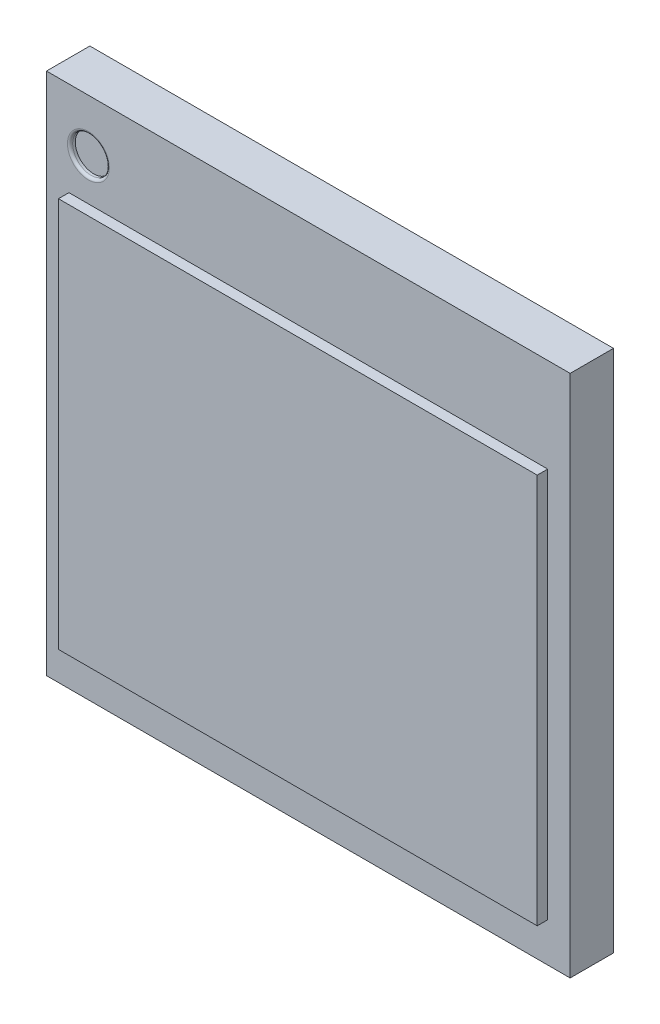
ISO-10303-21;
HEADER;
FILE_DESCRIPTION(('STEP AP214'),'2;1');
FILE_NAME('part.step','',(''),(''),'','','');
FILE_SCHEMA(('AUTOMOTIVE_DESIGN { 1 0 10303 214 1 1 1 1 }'));
ENDSEC;
DATA;
#1=APPLICATION_CONTEXT('core data for automotive mechanical design processes');
#2=APPLICATION_PROTOCOL_DEFINITION('international standard','automotive_design',2000,#1);
#3=PRODUCT_CONTEXT('',#1,'mechanical');
#4=PRODUCT('Part','Part','',(#3));
#5=PRODUCT_RELATED_PRODUCT_CATEGORY('part','',(#4));
#6=PRODUCT_DEFINITION_FORMATION('','',#4);
#7=PRODUCT_DEFINITION_CONTEXT('part definition',#1,'design');
#8=PRODUCT_DEFINITION('design','',#6,#7);
#9=PRODUCT_DEFINITION_SHAPE('','',#8);
#10=(LENGTH_UNIT() NAMED_UNIT(*) SI_UNIT(.MILLI.,.METRE.));
#11=(NAMED_UNIT(*) PLANE_ANGLE_UNIT() SI_UNIT($,.RADIAN.));
#12=(NAMED_UNIT(*) SI_UNIT($,.STERADIAN.) SOLID_ANGLE_UNIT());
#13=UNCERTAINTY_MEASURE_WITH_UNIT(LENGTH_MEASURE(1.E-05),#10,'distance_accuracy_value','');
#14=(GEOMETRIC_REPRESENTATION_CONTEXT(3) GLOBAL_UNCERTAINTY_ASSIGNED_CONTEXT((#13)) GLOBAL_UNIT_ASSIGNED_CONTEXT((#10,
#11,#12)) REPRESENTATION_CONTEXT('',''));
#15=CARTESIAN_POINT('',(0.,0.,0.));
#16=DIRECTION('',(0.,0.,1.));
#17=DIRECTION('',(1.,0.,0.));
#18=AXIS2_PLACEMENT_3D('',#15,#16,#17);
#19=CARTESIAN_POINT('',(0.,0.,0.624));
#20=DIRECTION('',(0.,0.,1.));
#21=DIRECTION('',(1.,0.,0.));
#22=AXIS2_PLACEMENT_3D('',#19,#20,#21);
#23=PLANE('',#22);
#24=CARTESIAN_POINT('',(-2.1,2.,0.624));
#25=DIRECTION('',(0.,0.,1.));
#26=DIRECTION('',(1.,0.,0.));
#27=AXIS2_PLACEMENT_3D('',#24,#25,#26);
#28=CIRCLE('',#27,0.2);
#29=CARTESIAN_POINT('',(-1.9,2.,0.624));
#30=VERTEX_POINT('',#29);
#31=EDGE_CURVE('E11',#30,#30,#28,.F.);
#32=ORIENTED_EDGE('',*,*,#31,.T.);
#33=EDGE_LOOP('',(#32));
#34=FACE_BOUND('',#33,.T.);
#35=DIRECTION('',(0.,-1.,0.));
#36=VECTOR('',#35,1.);
#37=CARTESIAN_POINT('',(-2.5,2.5,0.624));
#38=LINE('',#37,#36);
#39=CARTESIAN_POINT('',(-2.5,2.5,0.624));
#40=VERTEX_POINT('',#39);
#41=CARTESIAN_POINT('',(-2.5,-2.5,0.624));
#42=VERTEX_POINT('',#41);
#43=EDGE_CURVE('E144',#40,#42,#38,.T.);
#44=ORIENTED_EDGE('',*,*,#43,.T.);
#45=DIRECTION('',(1.,0.,0.));
#46=VECTOR('',#45,1.);
#47=CARTESIAN_POINT('',(-2.5,-2.5,0.624));
#48=LINE('',#47,#46);
#49=CARTESIAN_POINT('',(2.5,-2.5,0.624));
#50=VERTEX_POINT('',#49);
#51=EDGE_CURVE('E89',#42,#50,#48,.T.);
#52=ORIENTED_EDGE('',*,*,#51,.T.);
#53=DIRECTION('',(0.,1.,0.));
#54=VECTOR('',#53,1.);
#55=CARTESIAN_POINT('',(2.5,2.5,0.624));
#56=LINE('',#55,#54);
#57=CARTESIAN_POINT('',(2.5,2.5,0.624));
#58=VERTEX_POINT('',#57);
#59=EDGE_CURVE('E147',#50,#58,#56,.T.);
#60=ORIENTED_EDGE('',*,*,#59,.T.);
#61=DIRECTION('',(-1.,0.,0.));
#62=VECTOR('',#61,1.);
#63=CARTESIAN_POINT('',(-2.5,2.5,0.624));
#64=LINE('',#63,#62);
#65=EDGE_CURVE('E60',#58,#40,#64,.T.);
#66=ORIENTED_EDGE('',*,*,#65,.T.);
#67=EDGE_LOOP('',(#44,#52,#60,#66));
#68=FACE_BOUND('',#67,.T.);
#69=DIRECTION('',(-1.,0.,0.));
#70=VECTOR('',#69,1.);
#71=CARTESIAN_POINT('',(-2.28579882244162,1.60135243721626,0.624));
#72=LINE('',#71,#70);
#73=CARTESIAN_POINT('',(2.28579882244162,1.60135243721626,0.624));
#74=VERTEX_POINT('',#73);
#75=CARTESIAN_POINT('',(-2.28579882244162,1.60135243721626,0.624));
#76=VERTEX_POINT('',#75);
#77=EDGE_CURVE('E302',#74,#76,#72,.T.);
#78=ORIENTED_EDGE('',*,*,#77,.F.);
#79=DIRECTION('',(0.,1.,0.));
#80=VECTOR('',#79,1.);
#81=CARTESIAN_POINT('',(2.28579882244162,1.60135243721626,0.624));
#82=LINE('',#81,#80);
#83=CARTESIAN_POINT('',(2.28579882244162,-2.125692027521,0.624));
#84=VERTEX_POINT('',#83);
#85=EDGE_CURVE('E134',#84,#74,#82,.T.);
#86=ORIENTED_EDGE('',*,*,#85,.F.);
#87=DIRECTION('',(1.,0.,0.));
#88=VECTOR('',#87,1.);
#89=CARTESIAN_POINT('',(-2.28579882244162,-2.125692027521,0.624));
#90=LINE('',#89,#88);
#91=CARTESIAN_POINT('',(-2.28579882244162,-2.125692027521,0.624));
#92=VERTEX_POINT('',#91);
#93=EDGE_CURVE('E130',#92,#84,#90,.T.);
#94=ORIENTED_EDGE('',*,*,#93,.F.);
#95=DIRECTION('',(0.,-1.,0.));
#96=VECTOR('',#95,1.);
#97=CARTESIAN_POINT('',(-2.28579882244162,1.60135243721626,0.624));
#98=LINE('',#97,#96);
#99=EDGE_CURVE('E304',#76,#92,#98,.T.);
#100=ORIENTED_EDGE('',*,*,#99,.F.);
#101=EDGE_LOOP('',(#78,#86,#94,#100));
#102=FACE_BOUND('',#101,.T.);
#103=ADVANCED_FACE('F36',(#34,#68,#102),#23,.T.);
#104=CARTESIAN_POINT('',(0.,0.,0.21));
#105=DIRECTION('',(0.,0.,1.));
#106=DIRECTION('',(1.,0.,0.));
#107=AXIS2_PLACEMENT_3D('',#104,#105,#106);
#108=PLANE('',#107);
#109=DIRECTION('',(0.,-1.,0.));
#110=VECTOR('',#109,1.);
#111=CARTESIAN_POINT('',(-2.5,2.5,0.21));
#112=LINE('',#111,#110);
#113=CARTESIAN_POINT('',(-2.5,2.5,0.21));
#114=VERTEX_POINT('',#113);
#115=CARTESIAN_POINT('',(-2.5,-2.5,0.21));
#116=VERTEX_POINT('',#115);
#117=EDGE_CURVE('E139',#114,#116,#112,.T.);
#118=ORIENTED_EDGE('',*,*,#117,.F.);
#119=DIRECTION('',(-1.,0.,0.));
#120=VECTOR('',#119,1.);
#121=CARTESIAN_POINT('',(-2.5,2.5,0.21));
#122=LINE('',#121,#120);
#123=CARTESIAN_POINT('',(2.5,2.5,0.21));
#124=VERTEX_POINT('',#123);
#125=EDGE_CURVE('E81',#124,#114,#122,.T.);
#126=ORIENTED_EDGE('',*,*,#125,.F.);
#127=DIRECTION('',(0.,1.,0.));
#128=VECTOR('',#127,1.);
#129=CARTESIAN_POINT('',(2.5,2.5,0.21));
#130=LINE('',#129,#128);
#131=CARTESIAN_POINT('',(2.5,-2.5,0.21));
#132=VERTEX_POINT('',#131);
#133=EDGE_CURVE('E155',#132,#124,#130,.T.);
#134=ORIENTED_EDGE('',*,*,#133,.F.);
#135=DIRECTION('',(1.,0.,0.));
#136=VECTOR('',#135,1.);
#137=CARTESIAN_POINT('',(-2.5,-2.5,0.21));
#138=LINE('',#137,#136);
#139=EDGE_CURVE('E153',#116,#132,#138,.T.);
#140=ORIENTED_EDGE('',*,*,#139,.F.);
#141=EDGE_LOOP('',(#118,#126,#134,#140));
#142=FACE_BOUND('',#141,.T.);
#143=CARTESIAN_POINT('',(-1.96,1.9,0.21));
#144=DIRECTION('',(0.,0.,1.));
#145=DIRECTION('',(1.,0.,0.));
#146=AXIS2_PLACEMENT_3D('',#143,#144,#145);
#147=CIRCLE('',#146,0.148492424049175);
#148=CARTESIAN_POINT('',(-1.81150757595082,1.9,0.21));
#149=VERTEX_POINT('',#148);
#150=EDGE_CURVE('E166',#149,#149,#147,.F.);
#151=ORIENTED_EDGE('',*,*,#150,.F.);
#152=EDGE_LOOP('',(#151));
#153=FACE_BOUND('',#152,.T.);
#154=CARTESIAN_POINT('',(-1.16,1.9,0.21));
#155=DIRECTION('',(0.,0.,1.));
#156=DIRECTION('',(1.,0.,0.));
#157=AXIS2_PLACEMENT_3D('',#154,#155,#156);
#158=CIRCLE('',#157,0.148492424049175);
#159=CARTESIAN_POINT('',(-1.01150757595082,1.9,0.21));
#160=VERTEX_POINT('',#159);
#161=EDGE_CURVE('E169',#160,#160,#158,.F.);
#162=ORIENTED_EDGE('',*,*,#161,.F.);
#163=EDGE_LOOP('',(#162));
#164=FACE_BOUND('',#163,.T.);
#165=CARTESIAN_POINT('',(-0.36,1.9,0.21));
#166=DIRECTION('',(0.,0.,1.));
#167=DIRECTION('',(1.,0.,0.));
#168=AXIS2_PLACEMENT_3D('',#165,#166,#167);
#169=CIRCLE('',#168,0.148492424049175);
#170=CARTESIAN_POINT('',(-0.211507575950825,1.9,0.21));
#171=VERTEX_POINT('',#170);
#172=EDGE_CURVE('E172',#171,#171,#169,.F.);
#173=ORIENTED_EDGE('',*,*,#172,.F.);
#174=EDGE_LOOP('',(#173));
#175=FACE_BOUND('',#174,.T.);
#176=CARTESIAN_POINT('',(0.44,1.9,0.21));
#177=DIRECTION('',(0.,0.,1.));
#178=DIRECTION('',(1.,0.,0.));
#179=AXIS2_PLACEMENT_3D('',#176,#177,#178);
#180=CIRCLE('',#179,0.148492424049175);
#181=CARTESIAN_POINT('',(0.588492424049175,1.9,0.21));
#182=VERTEX_POINT('',#181);
#183=EDGE_CURVE('E175',#182,#182,#180,.F.);
#184=ORIENTED_EDGE('',*,*,#183,.F.);
#185=EDGE_LOOP('',(#184));
#186=FACE_BOUND('',#185,.T.);
#187=CARTESIAN_POINT('',(1.24,1.9,0.21));
#188=DIRECTION('',(0.,0.,1.));
#189=DIRECTION('',(1.,0.,0.));
#190=AXIS2_PLACEMENT_3D('',#187,#188,#189);
#191=CIRCLE('',#190,0.148492424049175);
#192=CARTESIAN_POINT('',(1.38849242404918,1.9,0.21));
#193=VERTEX_POINT('',#192);
#194=EDGE_CURVE('E178',#193,#193,#191,.F.);
#195=ORIENTED_EDGE('',*,*,#194,.F.);
#196=EDGE_LOOP('',(#195));
#197=FACE_BOUND('',#196,.T.);
#198=CARTESIAN_POINT('',(2.04,1.9,0.21));
#199=DIRECTION('',(0.,0.,1.));
#200=DIRECTION('',(1.,0.,0.));
#201=AXIS2_PLACEMENT_3D('',#198,#199,#200);
#202=CIRCLE('',#201,0.148492424049175);
#203=CARTESIAN_POINT('',(2.18849242404918,1.9,0.21));
#204=VERTEX_POINT('',#203);
#205=EDGE_CURVE('E181',#204,#204,#202,.F.);
#206=ORIENTED_EDGE('',*,*,#205,.F.);
#207=EDGE_LOOP('',(#206));
#208=FACE_BOUND('',#207,.T.);
#209=CARTESIAN_POINT('',(-1.96,1.15,0.21));
#210=DIRECTION('',(0.,0.,1.));
#211=DIRECTION('',(1.,0.,0.));
#212=AXIS2_PLACEMENT_3D('',#209,#210,#211);
#213=CIRCLE('',#212,0.148492424049175);
#214=CARTESIAN_POINT('',(-1.81150757595082,1.15,0.21));
#215=VERTEX_POINT('',#214);
#216=EDGE_CURVE('E184',#215,#215,#213,.F.);
#217=ORIENTED_EDGE('',*,*,#216,.F.);
#218=EDGE_LOOP('',(#217));
#219=FACE_BOUND('',#218,.T.);
#220=CARTESIAN_POINT('',(-1.16,1.15,0.21));
#221=DIRECTION('',(0.,0.,1.));
#222=DIRECTION('',(1.,0.,0.));
#223=AXIS2_PLACEMENT_3D('',#220,#221,#222);
#224=CIRCLE('',#223,0.148492424049175);
#225=CARTESIAN_POINT('',(-1.01150757595082,1.15,0.21));
#226=VERTEX_POINT('',#225);
#227=EDGE_CURVE('E187',#226,#226,#224,.F.);
#228=ORIENTED_EDGE('',*,*,#227,.F.);
#229=EDGE_LOOP('',(#228));
#230=FACE_BOUND('',#229,.T.);
#231=CARTESIAN_POINT('',(-0.36,1.15,0.21));
#232=DIRECTION('',(0.,0.,1.));
#233=DIRECTION('',(1.,0.,0.));
#234=AXIS2_PLACEMENT_3D('',#231,#232,#233);
#235=CIRCLE('',#234,0.148492424049175);
#236=CARTESIAN_POINT('',(-0.211507575950825,1.15,0.21));
#237=VERTEX_POINT('',#236);
#238=EDGE_CURVE('E190',#237,#237,#235,.F.);
#239=ORIENTED_EDGE('',*,*,#238,.F.);
#240=EDGE_LOOP('',(#239));
#241=FACE_BOUND('',#240,.T.);
#242=CARTESIAN_POINT('',(0.44,1.15,0.21));
#243=DIRECTION('',(0.,0.,1.));
#244=DIRECTION('',(1.,0.,0.));
#245=AXIS2_PLACEMENT_3D('',#242,#243,#244);
#246=CIRCLE('',#245,0.148492424049175);
#247=CARTESIAN_POINT('',(0.588492424049175,1.15,0.21));
#248=VERTEX_POINT('',#247);
#249=EDGE_CURVE('E193',#248,#248,#246,.F.);
#250=ORIENTED_EDGE('',*,*,#249,.F.);
#251=EDGE_LOOP('',(#250));
#252=FACE_BOUND('',#251,.T.);
#253=CARTESIAN_POINT('',(1.24,1.15,0.21));
#254=DIRECTION('',(0.,0.,1.));
#255=DIRECTION('',(1.,0.,0.));
#256=AXIS2_PLACEMENT_3D('',#253,#254,#255);
#257=CIRCLE('',#256,0.148492424049175);
#258=CARTESIAN_POINT('',(1.38849242404918,1.15,0.21));
#259=VERTEX_POINT('',#258);
#260=EDGE_CURVE('E196',#259,#259,#257,.F.);
#261=ORIENTED_EDGE('',*,*,#260,.F.);
#262=EDGE_LOOP('',(#261));
#263=FACE_BOUND('',#262,.T.);
#264=CARTESIAN_POINT('',(2.04,1.15,0.21));
#265=DIRECTION('',(0.,0.,1.));
#266=DIRECTION('',(1.,0.,0.));
#267=AXIS2_PLACEMENT_3D('',#264,#265,#266);
#268=CIRCLE('',#267,0.148492424049175);
#269=CARTESIAN_POINT('',(2.18849242404918,1.15,0.21));
#270=VERTEX_POINT('',#269);
#271=EDGE_CURVE('E199',#270,#270,#268,.F.);
#272=ORIENTED_EDGE('',*,*,#271,.F.);
#273=EDGE_LOOP('',(#272));
#274=FACE_BOUND('',#273,.T.);
#275=CARTESIAN_POINT('',(-1.96,0.4,0.21));
#276=DIRECTION('',(0.,0.,1.));
#277=DIRECTION('',(1.,0.,0.));
#278=AXIS2_PLACEMENT_3D('',#275,#276,#277);
#279=CIRCLE('',#278,0.148492424049175);
#280=CARTESIAN_POINT('',(-1.81150757595082,0.4,0.21));
#281=VERTEX_POINT('',#280);
#282=EDGE_CURVE('E202',#281,#281,#279,.F.);
#283=ORIENTED_EDGE('',*,*,#282,.F.);
#284=EDGE_LOOP('',(#283));
#285=FACE_BOUND('',#284,.T.);
#286=CARTESIAN_POINT('',(2.04,0.399999999999999,0.21));
#287=DIRECTION('',(0.,0.,1.));
#288=DIRECTION('',(1.,0.,0.));
#289=AXIS2_PLACEMENT_3D('',#286,#287,#288);
#290=CIRCLE('',#289,0.148492424049175);
#291=CARTESIAN_POINT('',(2.18849242404918,0.399999999999999,0.21));
#292=VERTEX_POINT('',#291);
#293=EDGE_CURVE('E205',#292,#292,#290,.F.);
#294=ORIENTED_EDGE('',*,*,#293,.F.);
#295=EDGE_LOOP('',(#294));
#296=FACE_BOUND('',#295,.T.);
#297=CARTESIAN_POINT('',(-1.96,-0.35,0.21));
#298=DIRECTION('',(0.,0.,1.));
#299=DIRECTION('',(1.,0.,0.));
#300=AXIS2_PLACEMENT_3D('',#297,#298,#299);
#301=CIRCLE('',#300,0.148492424049175);
#302=CARTESIAN_POINT('',(-1.81150757595082,-0.35,0.21));
#303=VERTEX_POINT('',#302);
#304=EDGE_CURVE('E208',#303,#303,#301,.F.);
#305=ORIENTED_EDGE('',*,*,#304,.F.);
#306=EDGE_LOOP('',(#305));
#307=FACE_BOUND('',#306,.T.);
#308=CARTESIAN_POINT('',(2.04,-0.350000000000001,0.21));
#309=DIRECTION('',(0.,0.,1.));
#310=DIRECTION('',(1.,0.,0.));
#311=AXIS2_PLACEMENT_3D('',#308,#309,#310);
#312=CIRCLE('',#311,0.148492424049175);
#313=CARTESIAN_POINT('',(2.18849242404918,-0.350000000000001,0.21));
#314=VERTEX_POINT('',#313);
#315=EDGE_CURVE('E211',#314,#314,#312,.F.);
#316=ORIENTED_EDGE('',*,*,#315,.F.);
#317=EDGE_LOOP('',(#316));
#318=FACE_BOUND('',#317,.T.);
#319=CARTESIAN_POINT('',(-1.96,-1.1,0.21));
#320=DIRECTION('',(0.,0.,1.));
#321=DIRECTION('',(1.,0.,0.));
#322=AXIS2_PLACEMENT_3D('',#319,#320,#321);
#323=CIRCLE('',#322,0.148492424049175);
#324=CARTESIAN_POINT('',(-1.81150757595082,-1.1,0.21));
#325=VERTEX_POINT('',#324);
#326=EDGE_CURVE('E214',#325,#325,#323,.F.);
#327=ORIENTED_EDGE('',*,*,#326,.F.);
#328=EDGE_LOOP('',(#327));
#329=FACE_BOUND('',#328,.T.);
#330=CARTESIAN_POINT('',(-1.16,-1.1,0.21));
#331=DIRECTION('',(0.,0.,1.));
#332=DIRECTION('',(1.,0.,0.));
#333=AXIS2_PLACEMENT_3D('',#330,#331,#332);
#334=CIRCLE('',#333,0.148492424049175);
#335=CARTESIAN_POINT('',(-1.01150757595082,-1.1,0.21));
#336=VERTEX_POINT('',#335);
#337=EDGE_CURVE('E217',#336,#336,#334,.F.);
#338=ORIENTED_EDGE('',*,*,#337,.F.);
#339=EDGE_LOOP('',(#338));
#340=FACE_BOUND('',#339,.T.);
#341=CARTESIAN_POINT('',(-0.359999999999999,-1.1,0.21));
#342=DIRECTION('',(0.,0.,1.));
#343=DIRECTION('',(1.,0.,0.));
#344=AXIS2_PLACEMENT_3D('',#341,#342,#343);
#345=CIRCLE('',#344,0.148492424049175);
#346=CARTESIAN_POINT('',(-0.211507575950824,-1.1,0.21));
#347=VERTEX_POINT('',#346);
#348=EDGE_CURVE('E220',#347,#347,#345,.F.);
#349=ORIENTED_EDGE('',*,*,#348,.F.);
#350=EDGE_LOOP('',(#349));
#351=FACE_BOUND('',#350,.T.);
#352=CARTESIAN_POINT('',(0.440000000000001,-1.1,0.21));
#353=DIRECTION('',(0.,0.,1.));
#354=DIRECTION('',(1.,0.,0.));
#355=AXIS2_PLACEMENT_3D('',#352,#353,#354);
#356=CIRCLE('',#355,0.148492424049175);
#357=CARTESIAN_POINT('',(0.588492424049176,-1.1,0.21));
#358=VERTEX_POINT('',#357);
#359=EDGE_CURVE('E223',#358,#358,#356,.F.);
#360=ORIENTED_EDGE('',*,*,#359,.F.);
#361=EDGE_LOOP('',(#360));
#362=FACE_BOUND('',#361,.T.);
#363=CARTESIAN_POINT('',(1.24,-1.1,0.21));
#364=DIRECTION('',(0.,0.,1.));
#365=DIRECTION('',(1.,0.,0.));
#366=AXIS2_PLACEMENT_3D('',#363,#364,#365);
#367=CIRCLE('',#366,0.148492424049175);
#368=CARTESIAN_POINT('',(1.38849242404918,-1.1,0.21));
#369=VERTEX_POINT('',#368);
#370=EDGE_CURVE('E226',#369,#369,#367,.F.);
#371=ORIENTED_EDGE('',*,*,#370,.F.);
#372=EDGE_LOOP('',(#371));
#373=FACE_BOUND('',#372,.T.);
#374=CARTESIAN_POINT('',(2.04,-1.1,0.21));
#375=DIRECTION('',(0.,0.,1.));
#376=DIRECTION('',(1.,0.,0.));
#377=AXIS2_PLACEMENT_3D('',#374,#375,#376);
#378=CIRCLE('',#377,0.148492424049175);
#379=CARTESIAN_POINT('',(2.18849242404918,-1.1,0.21));
#380=VERTEX_POINT('',#379);
#381=EDGE_CURVE('E229',#380,#380,#378,.F.);
#382=ORIENTED_EDGE('',*,*,#381,.F.);
#383=EDGE_LOOP('',(#382));
#384=FACE_BOUND('',#383,.T.);
#385=CARTESIAN_POINT('',(-1.96,-1.85,0.21));
#386=DIRECTION('',(0.,0.,1.));
#387=DIRECTION('',(1.,0.,0.));
#388=AXIS2_PLACEMENT_3D('',#385,#386,#387);
#389=CIRCLE('',#388,0.148492424049175);
#390=CARTESIAN_POINT('',(-1.81150757595082,-1.85,0.21));
#391=VERTEX_POINT('',#390);
#392=EDGE_CURVE('E232',#391,#391,#389,.F.);
#393=ORIENTED_EDGE('',*,*,#392,.F.);
#394=EDGE_LOOP('',(#393));
#395=FACE_BOUND('',#394,.T.);
#396=CARTESIAN_POINT('',(-1.16,-1.85,0.21));
#397=DIRECTION('',(0.,0.,1.));
#398=DIRECTION('',(1.,0.,0.));
#399=AXIS2_PLACEMENT_3D('',#396,#397,#398);
#400=CIRCLE('',#399,0.148492424049175);
#401=CARTESIAN_POINT('',(-1.01150757595082,-1.85,0.21));
#402=VERTEX_POINT('',#401);
#403=EDGE_CURVE('E235',#402,#402,#400,.F.);
#404=ORIENTED_EDGE('',*,*,#403,.F.);
#405=EDGE_LOOP('',(#404));
#406=FACE_BOUND('',#405,.T.);
#407=CARTESIAN_POINT('',(-0.359999999999999,-1.85,0.21));
#408=DIRECTION('',(0.,0.,1.));
#409=DIRECTION('',(1.,0.,0.));
#410=AXIS2_PLACEMENT_3D('',#407,#408,#409);
#411=CIRCLE('',#410,0.148492424049175);
#412=CARTESIAN_POINT('',(-0.211507575950824,-1.85,0.21));
#413=VERTEX_POINT('',#412);
#414=EDGE_CURVE('E238',#413,#413,#411,.F.);
#415=ORIENTED_EDGE('',*,*,#414,.F.);
#416=EDGE_LOOP('',(#415));
#417=FACE_BOUND('',#416,.T.);
#418=CARTESIAN_POINT('',(0.440000000000001,-1.85,0.21));
#419=DIRECTION('',(0.,0.,1.));
#420=DIRECTION('',(1.,0.,0.));
#421=AXIS2_PLACEMENT_3D('',#418,#419,#420);
#422=CIRCLE('',#421,0.148492424049175);
#423=CARTESIAN_POINT('',(0.588492424049176,-1.85,0.21));
#424=VERTEX_POINT('',#423);
#425=EDGE_CURVE('E241',#424,#424,#422,.F.);
#426=ORIENTED_EDGE('',*,*,#425,.F.);
#427=EDGE_LOOP('',(#426));
#428=FACE_BOUND('',#427,.T.);
#429=CARTESIAN_POINT('',(1.24,-1.85,0.21));
#430=DIRECTION('',(0.,0.,1.));
#431=DIRECTION('',(1.,0.,0.));
#432=AXIS2_PLACEMENT_3D('',#429,#430,#431);
#433=CIRCLE('',#432,0.148492424049175);
#434=CARTESIAN_POINT('',(1.38849242404918,-1.85,0.21));
#435=VERTEX_POINT('',#434);
#436=EDGE_CURVE('E244',#435,#435,#433,.F.);
#437=ORIENTED_EDGE('',*,*,#436,.F.);
#438=EDGE_LOOP('',(#437));
#439=FACE_BOUND('',#438,.T.);
#440=CARTESIAN_POINT('',(2.04,-1.85,0.21));
#441=DIRECTION('',(0.,0.,1.));
#442=DIRECTION('',(1.,0.,0.));
#443=AXIS2_PLACEMENT_3D('',#440,#441,#442);
#444=CIRCLE('',#443,0.148492424049175);
#445=CARTESIAN_POINT('',(2.18849242404918,-1.85,0.21));
#446=VERTEX_POINT('',#445);
#447=EDGE_CURVE('E247',#446,#446,#444,.F.);
#448=ORIENTED_EDGE('',*,*,#447,.F.);
#449=EDGE_LOOP('',(#448));
#450=FACE_BOUND('',#449,.T.);
#451=ADVANCED_FACE('F267',(#142,#153,#164,#175,#186,#197,#208,#219,#230,#241,#252,#263,#274,
#285,#296,#307,#318,#329,#340,#351,#362,#373,#384,#395,#406,#417,#428,#439,#450),#108,.F.);
#452=CARTESIAN_POINT('',(-2.5,2.5,0.624));
#453=DIRECTION('',(1.,0.,0.));
#454=DIRECTION('',(0.,1.,0.));
#455=AXIS2_PLACEMENT_3D('',#452,#453,#454);
#456=PLANE('',#455);
#457=ORIENTED_EDGE('',*,*,#117,.T.);
#458=DIRECTION('',(0.,0.,-1.));
#459=VECTOR('',#458,1.);
#460=CARTESIAN_POINT('',(-2.5,-2.5,0.624));
#461=LINE('',#460,#459);
#462=EDGE_CURVE('E164',#42,#116,#461,.T.);
#463=ORIENTED_EDGE('',*,*,#462,.F.);
#464=ORIENTED_EDGE('',*,*,#43,.F.);
#465=DIRECTION('',(0.,0.,-1.));
#466=VECTOR('',#465,1.);
#467=CARTESIAN_POINT('',(-2.5,2.5,0.624));
#468=LINE('',#467,#466);
#469=EDGE_CURVE('E150',#40,#114,#468,.T.);
#470=ORIENTED_EDGE('',*,*,#469,.T.);
#471=EDGE_LOOP('',(#457,#463,#464,#470));
#472=FACE_BOUND('',#471,.T.);
#473=ADVANCED_FACE('F273',(#472),#456,.F.);
#474=CARTESIAN_POINT('',(-2.5,-2.5,0.624));
#475=DIRECTION('',(0.,1.,0.));
#476=DIRECTION('',(0.,0.,1.));
#477=AXIS2_PLACEMENT_3D('',#474,#475,#476);
#478=PLANE('',#477);
#479=ORIENTED_EDGE('',*,*,#139,.T.);
#480=DIRECTION('',(0.,0.,-1.));
#481=VECTOR('',#480,1.);
#482=CARTESIAN_POINT('',(2.5,-2.5,0.624));
#483=LINE('',#482,#481);
#484=EDGE_CURVE('E161',#50,#132,#483,.T.);
#485=ORIENTED_EDGE('',*,*,#484,.F.);
#486=ORIENTED_EDGE('',*,*,#51,.F.);
#487=ORIENTED_EDGE('',*,*,#462,.T.);
#488=EDGE_LOOP('',(#479,#485,#486,#487));
#489=FACE_BOUND('',#488,.T.);
#490=ADVANCED_FACE('F286',(#489),#478,.F.);
#491=CARTESIAN_POINT('',(2.5,2.5,0.624));
#492=DIRECTION('',(-1.,0.,0.));
#493=DIRECTION('',(0.,0.,1.));
#494=AXIS2_PLACEMENT_3D('',#491,#492,#493);
#495=PLANE('',#494);
#496=ORIENTED_EDGE('',*,*,#133,.T.);
#497=DIRECTION('',(0.,0.,-1.));
#498=VECTOR('',#497,1.);
#499=CARTESIAN_POINT('',(2.5,2.5,0.624));
#500=LINE('',#499,#498);
#501=EDGE_CURVE('E159',#58,#124,#500,.T.);
#502=ORIENTED_EDGE('',*,*,#501,.F.);
#503=ORIENTED_EDGE('',*,*,#59,.F.);
#504=ORIENTED_EDGE('',*,*,#484,.T.);
#505=EDGE_LOOP('',(#496,#502,#503,#504));
#506=FACE_BOUND('',#505,.T.);
#507=ADVANCED_FACE('F283',(#506),#495,.F.);
#508=CARTESIAN_POINT('',(-2.5,2.5,0.624));
#509=DIRECTION('',(0.,-1.,0.));
#510=DIRECTION('',(1.,0.,0.));
#511=AXIS2_PLACEMENT_3D('',#508,#509,#510);
#512=PLANE('',#511);
#513=ORIENTED_EDGE('',*,*,#125,.T.);
#514=ORIENTED_EDGE('',*,*,#469,.F.);
#515=ORIENTED_EDGE('',*,*,#65,.F.);
#516=ORIENTED_EDGE('',*,*,#501,.T.);
#517=EDGE_LOOP('',(#513,#514,#515,#516));
#518=FACE_BOUND('',#517,.T.);
#519=ADVANCED_FACE('F280',(#518),#512,.F.);
#520=CARTESIAN_POINT('',(-1.96,1.9,0.1575));
#521=DIRECTION('',(0.,0.,1.));
#522=DIRECTION('',(-1.,0.,0.));
#523=AXIS2_PLACEMENT_3D('',#520,#521,#522);
#524=SPHERICAL_SURFACE('',#523,0.1575);
#525=ORIENTED_EDGE('',*,*,#150,.T.);
#526=EDGE_LOOP('',(#525));
#527=FACE_BOUND('',#526,.T.);
#528=ADVANCED_FACE('F277',(#527),#524,.T.);
#529=CARTESIAN_POINT('',(-1.16,1.9,0.1575));
#530=DIRECTION('',(0.,0.,1.));
#531=DIRECTION('',(-1.,0.,0.));
#532=AXIS2_PLACEMENT_3D('',#529,#530,#531);
#533=SPHERICAL_SURFACE('',#532,0.1575);
#534=ORIENTED_EDGE('',*,*,#161,.T.);
#535=EDGE_LOOP('',(#534));
#536=FACE_BOUND('',#535,.T.);
#537=ADVANCED_FACE('F431',(#536),#533,.T.);
#538=CARTESIAN_POINT('',(-0.36,1.9,0.1575));
#539=DIRECTION('',(0.,0.,1.));
#540=DIRECTION('',(-1.,0.,0.));
#541=AXIS2_PLACEMENT_3D('',#538,#539,#540);
#542=SPHERICAL_SURFACE('',#541,0.1575);
#543=ORIENTED_EDGE('',*,*,#172,.T.);
#544=EDGE_LOOP('',(#543));
#545=FACE_BOUND('',#544,.T.);
#546=ADVANCED_FACE('F428',(#545),#542,.T.);
#547=CARTESIAN_POINT('',(0.44,1.9,0.1575));
#548=DIRECTION('',(0.,0.,1.));
#549=DIRECTION('',(-1.,0.,0.));
#550=AXIS2_PLACEMENT_3D('',#547,#548,#549);
#551=SPHERICAL_SURFACE('',#550,0.1575);
#552=ORIENTED_EDGE('',*,*,#183,.T.);
#553=EDGE_LOOP('',(#552));
#554=FACE_BOUND('',#553,.T.);
#555=ADVANCED_FACE('F424',(#554),#551,.T.);
#556=CARTESIAN_POINT('',(1.24,1.9,0.1575));
#557=DIRECTION('',(0.,0.,1.));
#558=DIRECTION('',(-1.,0.,0.));
#559=AXIS2_PLACEMENT_3D('',#556,#557,#558);
#560=SPHERICAL_SURFACE('',#559,0.1575);
#561=ORIENTED_EDGE('',*,*,#194,.T.);
#562=EDGE_LOOP('',(#561));
#563=FACE_BOUND('',#562,.T.);
#564=ADVANCED_FACE('F420',(#563),#560,.T.);
#565=CARTESIAN_POINT('',(2.04,1.9,0.1575));
#566=DIRECTION('',(0.,0.,1.));
#567=DIRECTION('',(-1.,0.,0.));
#568=AXIS2_PLACEMENT_3D('',#565,#566,#567);
#569=SPHERICAL_SURFACE('',#568,0.1575);
#570=ORIENTED_EDGE('',*,*,#205,.T.);
#571=EDGE_LOOP('',(#570));
#572=FACE_BOUND('',#571,.T.);
#573=ADVANCED_FACE('F416',(#572),#569,.T.);
#574=CARTESIAN_POINT('',(-1.96,1.15,0.1575));
#575=DIRECTION('',(0.,0.,1.));
#576=DIRECTION('',(-1.,0.,0.));
#577=AXIS2_PLACEMENT_3D('',#574,#575,#576);
#578=SPHERICAL_SURFACE('',#577,0.1575);
#579=ORIENTED_EDGE('',*,*,#216,.T.);
#580=EDGE_LOOP('',(#579));
#581=FACE_BOUND('',#580,.T.);
#582=ADVANCED_FACE('F412',(#581),#578,.T.);
#583=CARTESIAN_POINT('',(-1.16,1.15,0.1575));
#584=DIRECTION('',(0.,0.,1.));
#585=DIRECTION('',(-1.,0.,0.));
#586=AXIS2_PLACEMENT_3D('',#583,#584,#585);
#587=SPHERICAL_SURFACE('',#586,0.1575);
#588=ORIENTED_EDGE('',*,*,#227,.T.);
#589=EDGE_LOOP('',(#588));
#590=FACE_BOUND('',#589,.T.);
#591=ADVANCED_FACE('F408',(#590),#587,.T.);
#592=CARTESIAN_POINT('',(-0.36,1.15,0.1575));
#593=DIRECTION('',(0.,0.,1.));
#594=DIRECTION('',(-1.,0.,0.));
#595=AXIS2_PLACEMENT_3D('',#592,#593,#594);
#596=SPHERICAL_SURFACE('',#595,0.1575);
#597=ORIENTED_EDGE('',*,*,#238,.T.);
#598=EDGE_LOOP('',(#597));
#599=FACE_BOUND('',#598,.T.);
#600=ADVANCED_FACE('F404',(#599),#596,.T.);
#601=CARTESIAN_POINT('',(0.44,1.15,0.1575));
#602=DIRECTION('',(0.,0.,1.));
#603=DIRECTION('',(-1.,0.,0.));
#604=AXIS2_PLACEMENT_3D('',#601,#602,#603);
#605=SPHERICAL_SURFACE('',#604,0.1575);
#606=ORIENTED_EDGE('',*,*,#249,.T.);
#607=EDGE_LOOP('',(#606));
#608=FACE_BOUND('',#607,.T.);
#609=ADVANCED_FACE('F400',(#608),#605,.T.);
#610=CARTESIAN_POINT('',(1.24,1.15,0.1575));
#611=DIRECTION('',(0.,0.,1.));
#612=DIRECTION('',(-1.,0.,0.));
#613=AXIS2_PLACEMENT_3D('',#610,#611,#612);
#614=SPHERICAL_SURFACE('',#613,0.1575);
#615=ORIENTED_EDGE('',*,*,#260,.T.);
#616=EDGE_LOOP('',(#615));
#617=FACE_BOUND('',#616,.T.);
#618=ADVANCED_FACE('F396',(#617),#614,.T.);
#619=CARTESIAN_POINT('',(2.04,1.15,0.1575));
#620=DIRECTION('',(0.,0.,1.));
#621=DIRECTION('',(-1.,0.,0.));
#622=AXIS2_PLACEMENT_3D('',#619,#620,#621);
#623=SPHERICAL_SURFACE('',#622,0.1575);
#624=ORIENTED_EDGE('',*,*,#271,.T.);
#625=EDGE_LOOP('',(#624));
#626=FACE_BOUND('',#625,.T.);
#627=ADVANCED_FACE('F392',(#626),#623,.T.);
#628=CARTESIAN_POINT('',(-1.96,0.4,0.1575));
#629=DIRECTION('',(0.,0.,1.));
#630=DIRECTION('',(-1.,0.,0.));
#631=AXIS2_PLACEMENT_3D('',#628,#629,#630);
#632=SPHERICAL_SURFACE('',#631,0.1575);
#633=ORIENTED_EDGE('',*,*,#282,.T.);
#634=EDGE_LOOP('',(#633));
#635=FACE_BOUND('',#634,.T.);
#636=ADVANCED_FACE('F388',(#635),#632,.T.);
#637=CARTESIAN_POINT('',(2.04,0.399999999999999,0.1575));
#638=DIRECTION('',(0.,0.,1.));
#639=DIRECTION('',(-1.,0.,0.));
#640=AXIS2_PLACEMENT_3D('',#637,#638,#639);
#641=SPHERICAL_SURFACE('',#640,0.1575);
#642=ORIENTED_EDGE('',*,*,#293,.T.);
#643=EDGE_LOOP('',(#642));
#644=FACE_BOUND('',#643,.T.);
#645=ADVANCED_FACE('F384',(#644),#641,.T.);
#646=CARTESIAN_POINT('',(-1.96,-0.35,0.1575));
#647=DIRECTION('',(0.,0.,1.));
#648=DIRECTION('',(-1.,0.,0.));
#649=AXIS2_PLACEMENT_3D('',#646,#647,#648);
#650=SPHERICAL_SURFACE('',#649,0.1575);
#651=ORIENTED_EDGE('',*,*,#304,.T.);
#652=EDGE_LOOP('',(#651));
#653=FACE_BOUND('',#652,.T.);
#654=ADVANCED_FACE('F380',(#653),#650,.T.);
#655=CARTESIAN_POINT('',(2.04,-0.350000000000001,0.1575));
#656=DIRECTION('',(0.,0.,1.));
#657=DIRECTION('',(-1.,0.,0.));
#658=AXIS2_PLACEMENT_3D('',#655,#656,#657);
#659=SPHERICAL_SURFACE('',#658,0.1575);
#660=ORIENTED_EDGE('',*,*,#315,.T.);
#661=EDGE_LOOP('',(#660));
#662=FACE_BOUND('',#661,.T.);
#663=ADVANCED_FACE('F376',(#662),#659,.T.);
#664=CARTESIAN_POINT('',(-1.96,-1.1,0.1575));
#665=DIRECTION('',(0.,0.,1.));
#666=DIRECTION('',(-1.,0.,0.));
#667=AXIS2_PLACEMENT_3D('',#664,#665,#666);
#668=SPHERICAL_SURFACE('',#667,0.1575);
#669=ORIENTED_EDGE('',*,*,#326,.T.);
#670=EDGE_LOOP('',(#669));
#671=FACE_BOUND('',#670,.T.);
#672=ADVANCED_FACE('F372',(#671),#668,.T.);
#673=CARTESIAN_POINT('',(-1.16,-1.1,0.1575));
#674=DIRECTION('',(0.,0.,1.));
#675=DIRECTION('',(-1.,0.,0.));
#676=AXIS2_PLACEMENT_3D('',#673,#674,#675);
#677=SPHERICAL_SURFACE('',#676,0.1575);
#678=ORIENTED_EDGE('',*,*,#337,.T.);
#679=EDGE_LOOP('',(#678));
#680=FACE_BOUND('',#679,.T.);
#681=ADVANCED_FACE('F368',(#680),#677,.T.);
#682=CARTESIAN_POINT('',(-0.359999999999999,-1.1,0.1575));
#683=DIRECTION('',(0.,0.,1.));
#684=DIRECTION('',(-1.,0.,0.));
#685=AXIS2_PLACEMENT_3D('',#682,#683,#684);
#686=SPHERICAL_SURFACE('',#685,0.1575);
#687=ORIENTED_EDGE('',*,*,#348,.T.);
#688=EDGE_LOOP('',(#687));
#689=FACE_BOUND('',#688,.T.);
#690=ADVANCED_FACE('F364',(#689),#686,.T.);
#691=CARTESIAN_POINT('',(0.440000000000001,-1.1,0.1575));
#692=DIRECTION('',(0.,0.,1.));
#693=DIRECTION('',(-1.,0.,0.));
#694=AXIS2_PLACEMENT_3D('',#691,#692,#693);
#695=SPHERICAL_SURFACE('',#694,0.1575);
#696=ORIENTED_EDGE('',*,*,#359,.T.);
#697=EDGE_LOOP('',(#696));
#698=FACE_BOUND('',#697,.T.);
#699=ADVANCED_FACE('F360',(#698),#695,.T.);
#700=CARTESIAN_POINT('',(1.24,-1.1,0.1575));
#701=DIRECTION('',(0.,0.,1.));
#702=DIRECTION('',(-1.,0.,0.));
#703=AXIS2_PLACEMENT_3D('',#700,#701,#702);
#704=SPHERICAL_SURFACE('',#703,0.1575);
#705=ORIENTED_EDGE('',*,*,#370,.T.);
#706=EDGE_LOOP('',(#705));
#707=FACE_BOUND('',#706,.T.);
#708=ADVANCED_FACE('F356',(#707),#704,.T.);
#709=CARTESIAN_POINT('',(2.04,-1.1,0.1575));
#710=DIRECTION('',(0.,0.,1.));
#711=DIRECTION('',(-1.,0.,0.));
#712=AXIS2_PLACEMENT_3D('',#709,#710,#711);
#713=SPHERICAL_SURFACE('',#712,0.1575);
#714=ORIENTED_EDGE('',*,*,#381,.T.);
#715=EDGE_LOOP('',(#714));
#716=FACE_BOUND('',#715,.T.);
#717=ADVANCED_FACE('F352',(#716),#713,.T.);
#718=CARTESIAN_POINT('',(-1.96,-1.85,0.1575));
#719=DIRECTION('',(0.,0.,1.));
#720=DIRECTION('',(-1.,0.,0.));
#721=AXIS2_PLACEMENT_3D('',#718,#719,#720);
#722=SPHERICAL_SURFACE('',#721,0.1575);
#723=ORIENTED_EDGE('',*,*,#392,.T.);
#724=EDGE_LOOP('',(#723));
#725=FACE_BOUND('',#724,.T.);
#726=ADVANCED_FACE('F348',(#725),#722,.T.);
#727=CARTESIAN_POINT('',(-1.16,-1.85,0.1575));
#728=DIRECTION('',(0.,0.,1.));
#729=DIRECTION('',(-1.,0.,0.));
#730=AXIS2_PLACEMENT_3D('',#727,#728,#729);
#731=SPHERICAL_SURFACE('',#730,0.1575);
#732=ORIENTED_EDGE('',*,*,#403,.T.);
#733=EDGE_LOOP('',(#732));
#734=FACE_BOUND('',#733,.T.);
#735=ADVANCED_FACE('F344',(#734),#731,.T.);
#736=CARTESIAN_POINT('',(-0.359999999999999,-1.85,0.1575));
#737=DIRECTION('',(0.,0.,1.));
#738=DIRECTION('',(-1.,0.,0.));
#739=AXIS2_PLACEMENT_3D('',#736,#737,#738);
#740=SPHERICAL_SURFACE('',#739,0.1575);
#741=ORIENTED_EDGE('',*,*,#414,.T.);
#742=EDGE_LOOP('',(#741));
#743=FACE_BOUND('',#742,.T.);
#744=ADVANCED_FACE('F340',(#743),#740,.T.);
#745=CARTESIAN_POINT('',(0.440000000000001,-1.85,0.1575));
#746=DIRECTION('',(0.,0.,1.));
#747=DIRECTION('',(-1.,0.,0.));
#748=AXIS2_PLACEMENT_3D('',#745,#746,#747);
#749=SPHERICAL_SURFACE('',#748,0.1575);
#750=ORIENTED_EDGE('',*,*,#425,.T.);
#751=EDGE_LOOP('',(#750));
#752=FACE_BOUND('',#751,.T.);
#753=ADVANCED_FACE('F336',(#752),#749,.T.);
#754=CARTESIAN_POINT('',(1.24,-1.85,0.1575));
#755=DIRECTION('',(0.,0.,1.));
#756=DIRECTION('',(-1.,0.,0.));
#757=AXIS2_PLACEMENT_3D('',#754,#755,#756);
#758=SPHERICAL_SURFACE('',#757,0.1575);
#759=ORIENTED_EDGE('',*,*,#436,.T.);
#760=EDGE_LOOP('',(#759));
#761=FACE_BOUND('',#760,.T.);
#762=ADVANCED_FACE('F332',(#761),#758,.T.);
#763=CARTESIAN_POINT('',(2.04,-1.85,0.1575));
#764=DIRECTION('',(0.,0.,1.));
#765=DIRECTION('',(-1.,0.,0.));
#766=AXIS2_PLACEMENT_3D('',#763,#764,#765);
#767=SPHERICAL_SURFACE('',#766,0.1575);
#768=ORIENTED_EDGE('',*,*,#447,.T.);
#769=EDGE_LOOP('',(#768));
#770=FACE_BOUND('',#769,.T.);
#771=ADVANCED_FACE('F329',(#770),#767,.T.);
#772=CARTESIAN_POINT('',(-2.1,2.,0.574));
#773=DIRECTION('',(0.,0.,1.));
#774=DIRECTION('',(1.,0.,0.));
#775=AXIS2_PLACEMENT_3D('',#772,#773,#774);
#776=CYLINDRICAL_SURFACE('',#775,0.175);
#777=CARTESIAN_POINT('',(-2.1,2.,0.599));
#778=DIRECTION('',(0.,0.,1.));
#779=DIRECTION('',(1.,0.,0.));
#780=AXIS2_PLACEMENT_3D('',#777,#778,#779);
#781=CIRCLE('',#780,0.175);
#782=CARTESIAN_POINT('',(-1.925,2.,0.599));
#783=VERTEX_POINT('',#782);
#784=EDGE_CURVE('E44',#783,#783,#781,.T.);
#785=ORIENTED_EDGE('',*,*,#784,.T.);
#786=EDGE_LOOP('',(#785));
#787=FACE_BOUND('',#786,.T.);
#788=CARTESIAN_POINT('',(-2.1,2.,0.574));
#789=DIRECTION('',(0.,0.,1.));
#790=DIRECTION('',(1.,0.,0.));
#791=AXIS2_PLACEMENT_3D('',#788,#789,#790);
#792=CIRCLE('',#791,0.175);
#793=CARTESIAN_POINT('',(-1.925,2.,0.574));
#794=VERTEX_POINT('',#793);
#795=EDGE_CURVE('E136',#794,#794,#792,.T.);
#796=ORIENTED_EDGE('',*,*,#795,.F.);
#797=EDGE_LOOP('',(#796));
#798=FACE_BOUND('',#797,.T.);
#799=ADVANCED_FACE('F252',(#787,#798),#776,.F.);
#800=CARTESIAN_POINT('',(-2.1,2.,0.574));
#801=DIRECTION('',(0.,0.,1.));
#802=DIRECTION('',(1.,0.,0.));
#803=AXIS2_PLACEMENT_3D('',#800,#801,#802);
#804=PLANE('',#803);
#805=ORIENTED_EDGE('',*,*,#795,.T.);
#806=EDGE_LOOP('',(#805));
#807=FACE_BOUND('',#806,.T.);
#808=ADVANCED_FACE('F256',(#807),#804,.T.);
#809=CARTESIAN_POINT('',(-2.1,2.,0.599));
#810=DIRECTION('',(0.,0.,1.));
#811=DIRECTION('',(1.,0.,0.));
#812=AXIS2_PLACEMENT_3D('',#809,#810,#811);
#813=TOROIDAL_SURFACE('',#812,0.2,0.025);
#814=ORIENTED_EDGE('',*,*,#31,.F.);
#815=EDGE_LOOP('',(#814));
#816=FACE_BOUND('',#815,.T.);
#817=ORIENTED_EDGE('',*,*,#784,.F.);
#818=EDGE_LOOP('',(#817));
#819=FACE_BOUND('',#818,.T.);
#820=ADVANCED_FACE('F38',(#816,#819),#813,.T.);
#821=CARTESIAN_POINT('',(2.28579882244162,1.60135243721626,0.724));
#822=DIRECTION('',(-1.,0.,0.));
#823=DIRECTION('',(0.,0.,1.));
#824=AXIS2_PLACEMENT_3D('',#821,#822,#823);
#825=PLANE('',#824);
#826=ORIENTED_EDGE('',*,*,#85,.T.);
#827=DIRECTION('',(0.,0.,-1.));
#828=VECTOR('',#827,1.);
#829=CARTESIAN_POINT('',(2.28579882244162,1.60135243721626,0.724));
#830=LINE('',#829,#828);
#831=CARTESIAN_POINT('',(2.28579882244162,1.60135243721626,0.724));
#832=VERTEX_POINT('',#831);
#833=EDGE_CURVE('E115',#832,#74,#830,.T.);
#834=ORIENTED_EDGE('',*,*,#833,.F.);
#835=DIRECTION('',(0.,1.,0.));
#836=VECTOR('',#835,1.);
#837=CARTESIAN_POINT('',(2.28579882244162,1.60135243721626,0.724));
#838=LINE('',#837,#836);
#839=CARTESIAN_POINT('',(2.28579882244162,-2.125692027521,0.724));
#840=VERTEX_POINT('',#839);
#841=EDGE_CURVE('E122',#840,#832,#838,.T.);
#842=ORIENTED_EDGE('',*,*,#841,.F.);
#843=DIRECTION('',(0.,0.,-1.));
#844=VECTOR('',#843,1.);
#845=CARTESIAN_POINT('',(2.28579882244162,-2.125692027521,0.724));
#846=LINE('',#845,#844);
#847=EDGE_CURVE('E311',#840,#84,#846,.T.);
#848=ORIENTED_EDGE('',*,*,#847,.T.);
#849=EDGE_LOOP('',(#826,#834,#842,#848));
#850=FACE_BOUND('',#849,.T.);
#851=ADVANCED_FACE('F132',(#850),#825,.F.);
#852=CARTESIAN_POINT('',(-2.28579882244162,1.60135243721626,0.724));
#853=DIRECTION('',(0.,-1.,0.));
#854=DIRECTION('',(0.,0.,-1.));
#855=AXIS2_PLACEMENT_3D('',#852,#853,#854);
#856=PLANE('',#855);
#857=ORIENTED_EDGE('',*,*,#77,.T.);
#858=DIRECTION('',(0.,0.,-1.));
#859=VECTOR('',#858,1.);
#860=CARTESIAN_POINT('',(-2.28579882244162,1.60135243721626,0.724));
#861=LINE('',#860,#859);
#862=CARTESIAN_POINT('',(-2.28579882244162,1.60135243721626,0.724));
#863=VERTEX_POINT('',#862);
#864=EDGE_CURVE('E118',#863,#76,#861,.T.);
#865=ORIENTED_EDGE('',*,*,#864,.F.);
#866=DIRECTION('',(-1.,0.,0.));
#867=VECTOR('',#866,1.);
#868=CARTESIAN_POINT('',(-2.28579882244162,1.60135243721626,0.724));
#869=LINE('',#868,#867);
#870=EDGE_CURVE('E111',#832,#863,#869,.T.);
#871=ORIENTED_EDGE('',*,*,#870,.F.);
#872=ORIENTED_EDGE('',*,*,#833,.T.);
#873=EDGE_LOOP('',(#857,#865,#871,#872));
#874=FACE_BOUND('',#873,.T.);
#875=ADVANCED_FACE('F113',(#874),#856,.F.);
#876=CARTESIAN_POINT('',(-2.28579882244162,1.60135243721626,0.724));
#877=DIRECTION('',(1.,0.,0.));
#878=DIRECTION('',(0.,0.,-1.));
#879=AXIS2_PLACEMENT_3D('',#876,#877,#878);
#880=PLANE('',#879);
#881=ORIENTED_EDGE('',*,*,#99,.T.);
#882=DIRECTION('',(0.,0.,-1.));
#883=VECTOR('',#882,1.);
#884=CARTESIAN_POINT('',(-2.28579882244162,-2.125692027521,0.724));
#885=LINE('',#884,#883);
#886=CARTESIAN_POINT('',(-2.28579882244162,-2.125692027521,0.724));
#887=VERTEX_POINT('',#886);
#888=EDGE_CURVE('E51',#887,#92,#885,.T.);
#889=ORIENTED_EDGE('',*,*,#888,.F.);
#890=DIRECTION('',(0.,-1.,0.));
#891=VECTOR('',#890,1.);
#892=CARTESIAN_POINT('',(-2.28579882244162,1.60135243721626,0.724));
#893=LINE('',#892,#891);
#894=EDGE_CURVE('E121',#863,#887,#893,.T.);
#895=ORIENTED_EDGE('',*,*,#894,.F.);
#896=ORIENTED_EDGE('',*,*,#864,.T.);
#897=EDGE_LOOP('',(#881,#889,#895,#896));
#898=FACE_BOUND('',#897,.T.);
#899=ADVANCED_FACE('F314',(#898),#880,.F.);
#900=CARTESIAN_POINT('',(-2.28579882244162,-2.125692027521,0.724));
#901=DIRECTION('',(0.,1.,0.));
#902=DIRECTION('',(0.,0.,1.));
#903=AXIS2_PLACEMENT_3D('',#900,#901,#902);
#904=PLANE('',#903);
#905=ORIENTED_EDGE('',*,*,#93,.T.);
#906=ORIENTED_EDGE('',*,*,#847,.F.);
#907=DIRECTION('',(1.,0.,0.));
#908=VECTOR('',#907,1.);
#909=CARTESIAN_POINT('',(-2.28579882244162,-2.125692027521,0.724));
#910=LINE('',#909,#908);
#911=EDGE_CURVE('E126',#887,#840,#910,.T.);
#912=ORIENTED_EDGE('',*,*,#911,.F.);
#913=ORIENTED_EDGE('',*,*,#888,.T.);
#914=EDGE_LOOP('',(#905,#906,#912,#913));
#915=FACE_BOUND('',#914,.T.);
#916=ADVANCED_FACE('F315',(#915),#904,.F.);
#917=CARTESIAN_POINT('',(0.,0.,0.724));
#918=DIRECTION('',(0.,0.,1.));
#919=DIRECTION('',(1.,0.,0.));
#920=AXIS2_PLACEMENT_3D('',#917,#918,#919);
#921=PLANE('',#920);
#922=ORIENTED_EDGE('',*,*,#841,.T.);
#923=ORIENTED_EDGE('',*,*,#870,.T.);
#924=ORIENTED_EDGE('',*,*,#894,.T.);
#925=ORIENTED_EDGE('',*,*,#911,.T.);
#926=EDGE_LOOP('',(#922,#923,#924,#925));
#927=FACE_BOUND('',#926,.T.);
#928=ADVANCED_FACE('F125',(#927),#921,.T.);
#929=CLOSED_SHELL('',(#103,#451,#473,#490,#507,#519,#528,#537,#546,#555,#564,#573,#582,#591,
#600,#609,#618,#627,#636,#645,#654,#663,#672,#681,#690,#699,#708,#717,#726,#735,#744,#753,#762,
#771,#799,#808,#820,#851,#875,#899,#916,#928));
#930=MANIFOLD_SOLID_BREP('B2',#929);
#931=ADVANCED_BREP_SHAPE_REPRESENTATION('',(#18,#930),#14);
#932=SHAPE_DEFINITION_REPRESENTATION(#9,#931);
ENDSEC;
END-ISO-10303-21;
